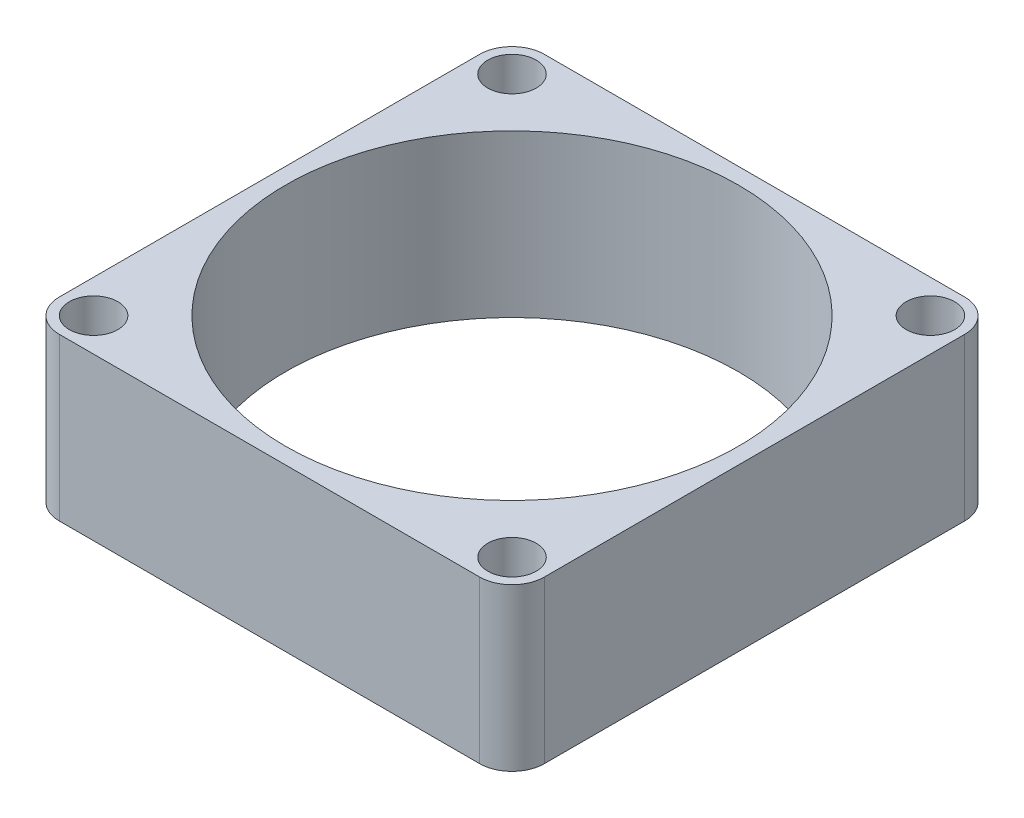
ISO-10303-21;
HEADER;
FILE_DESCRIPTION(('STEP AP214'),'2;1');
FILE_NAME('part.step','',(''),(''),'','','');
FILE_SCHEMA(('AUTOMOTIVE_DESIGN { 1 0 10303 214 1 1 1 1 }'));
ENDSEC;
DATA;
#1=APPLICATION_CONTEXT('core data for automotive mechanical design processes');
#2=APPLICATION_PROTOCOL_DEFINITION('international standard','automotive_design',2000,#1);
#3=PRODUCT_CONTEXT('',#1,'mechanical');
#4=PRODUCT('Part','Part','',(#3));
#5=PRODUCT_RELATED_PRODUCT_CATEGORY('part','',(#4));
#6=PRODUCT_DEFINITION_FORMATION('','',#4);
#7=PRODUCT_DEFINITION_CONTEXT('part definition',#1,'design');
#8=PRODUCT_DEFINITION('design','',#6,#7);
#9=PRODUCT_DEFINITION_SHAPE('','',#8);
#10=(LENGTH_UNIT() NAMED_UNIT(*) SI_UNIT(.MILLI.,.METRE.));
#11=(NAMED_UNIT(*) PLANE_ANGLE_UNIT() SI_UNIT($,.RADIAN.));
#12=(NAMED_UNIT(*) SI_UNIT($,.STERADIAN.) SOLID_ANGLE_UNIT());
#13=UNCERTAINTY_MEASURE_WITH_UNIT(LENGTH_MEASURE(1.E-05),#10,'distance_accuracy_value','');
#14=(GEOMETRIC_REPRESENTATION_CONTEXT(3) GLOBAL_UNCERTAINTY_ASSIGNED_CONTEXT((#13)) GLOBAL_UNIT_ASSIGNED_CONTEXT((#10,
#11,#12)) REPRESENTATION_CONTEXT('',''));
#15=CARTESIAN_POINT('',(0.,0.,0.));
#16=DIRECTION('',(0.,0.,1.));
#17=DIRECTION('',(1.,0.,0.));
#18=AXIS2_PLACEMENT_3D('',#15,#16,#17);
#19=CARTESIAN_POINT('',(-15.,10.,15.));
#20=DIRECTION('',(1.,0.,0.));
#21=DIRECTION('',(0.,0.,-1.));
#22=AXIS2_PLACEMENT_3D('',#19,#20,#21);
#23=PLANE('',#22);
#24=DIRECTION('',(0.,0.,1.));
#25=VECTOR('',#24,1.);
#26=CARTESIAN_POINT('',(-15.,0.,15.));
#27=LINE('',#26,#25);
#28=CARTESIAN_POINT('',(-15.,0.,-13.));
#29=VERTEX_POINT('',#28);
#30=CARTESIAN_POINT('',(-15.,0.,13.));
#31=VERTEX_POINT('',#30);
#32=EDGE_CURVE('E115',#29,#31,#27,.T.);
#33=ORIENTED_EDGE('',*,*,#32,.T.);
#34=DIRECTION('',(0.,-1.,0.));
#35=VECTOR('',#34,1.);
#36=CARTESIAN_POINT('',(-15.,10.,13.));
#37=LINE('',#36,#35);
#38=CARTESIAN_POINT('',(-15.,10.,13.));
#39=VERTEX_POINT('',#38);
#40=EDGE_CURVE('E12',#31,#39,#37,.F.);
#41=ORIENTED_EDGE('',*,*,#40,.T.);
#42=DIRECTION('',(0.,0.,1.));
#43=VECTOR('',#42,1.);
#44=CARTESIAN_POINT('',(-15.,10.,15.));
#45=LINE('',#44,#43);
#46=CARTESIAN_POINT('',(-15.,10.,-13.));
#47=VERTEX_POINT('',#46);
#48=EDGE_CURVE('E117',#47,#39,#45,.T.);
#49=ORIENTED_EDGE('',*,*,#48,.F.);
#50=DIRECTION('',(0.,-1.,0.));
#51=VECTOR('',#50,1.);
#52=CARTESIAN_POINT('',(-15.,10.,-13.));
#53=LINE('',#52,#51);
#54=EDGE_CURVE('E105',#47,#29,#53,.T.);
#55=ORIENTED_EDGE('',*,*,#54,.T.);
#56=EDGE_LOOP('',(#33,#41,#49,#55));
#57=FACE_BOUND('',#56,.T.);
#58=ADVANCED_FACE('F35',(#57),#23,.F.);
#59=CARTESIAN_POINT('',(15.,10.,15.));
#60=DIRECTION('',(0.,0.,-1.));
#61=DIRECTION('',(-1.,0.,0.));
#62=AXIS2_PLACEMENT_3D('',#59,#60,#61);
#63=PLANE('',#62);
#64=DIRECTION('',(1.,0.,0.));
#65=VECTOR('',#64,1.);
#66=CARTESIAN_POINT('',(15.,0.,15.));
#67=LINE('',#66,#65);
#68=CARTESIAN_POINT('',(-13.,0.,15.));
#69=VERTEX_POINT('',#68);
#70=CARTESIAN_POINT('',(13.,0.,15.));
#71=VERTEX_POINT('',#70);
#72=EDGE_CURVE('E123',#69,#71,#67,.T.);
#73=ORIENTED_EDGE('',*,*,#72,.T.);
#74=DIRECTION('',(0.,-1.,0.));
#75=VECTOR('',#74,1.);
#76=CARTESIAN_POINT('',(13.,10.,15.));
#77=LINE('',#76,#75);
#78=CARTESIAN_POINT('',(13.,10.,15.));
#79=VERTEX_POINT('',#78);
#80=EDGE_CURVE('E43',#71,#79,#77,.F.);
#81=ORIENTED_EDGE('',*,*,#80,.T.);
#82=DIRECTION('',(1.,0.,0.));
#83=VECTOR('',#82,1.);
#84=CARTESIAN_POINT('',(15.,10.,15.));
#85=LINE('',#84,#83);
#86=CARTESIAN_POINT('',(-13.,10.,15.));
#87=VERTEX_POINT('',#86);
#88=EDGE_CURVE('E163',#87,#79,#85,.T.);
#89=ORIENTED_EDGE('',*,*,#88,.F.);
#90=DIRECTION('',(0.,-1.,0.));
#91=VECTOR('',#90,1.);
#92=CARTESIAN_POINT('',(-13.,10.,15.));
#93=LINE('',#92,#91);
#94=EDGE_CURVE('E159',#87,#69,#93,.T.);
#95=ORIENTED_EDGE('',*,*,#94,.T.);
#96=EDGE_LOOP('',(#73,#81,#89,#95));
#97=FACE_BOUND('',#96,.T.);
#98=ADVANCED_FACE('F162',(#97),#63,.F.);
#99=CARTESIAN_POINT('',(15.,10.,15.));
#100=DIRECTION('',(-1.,0.,0.));
#101=DIRECTION('',(0.,0.,1.));
#102=AXIS2_PLACEMENT_3D('',#99,#100,#101);
#103=PLANE('',#102);
#104=DIRECTION('',(0.,0.,-1.));
#105=VECTOR('',#104,1.);
#106=CARTESIAN_POINT('',(15.,0.,15.));
#107=LINE('',#106,#105);
#108=CARTESIAN_POINT('',(15.,0.,13.));
#109=VERTEX_POINT('',#108);
#110=CARTESIAN_POINT('',(15.,0.,-13.));
#111=VERTEX_POINT('',#110);
#112=EDGE_CURVE('E126',#109,#111,#107,.T.);
#113=ORIENTED_EDGE('',*,*,#112,.T.);
#114=DIRECTION('',(0.,-1.,0.));
#115=VECTOR('',#114,1.);
#116=CARTESIAN_POINT('',(15.,10.,-13.));
#117=LINE('',#116,#115);
#118=CARTESIAN_POINT('',(15.,10.,-13.));
#119=VERTEX_POINT('',#118);
#120=EDGE_CURVE('E152',#111,#119,#117,.F.);
#121=ORIENTED_EDGE('',*,*,#120,.T.);
#122=DIRECTION('',(0.,0.,-1.));
#123=VECTOR('',#122,1.);
#124=CARTESIAN_POINT('',(15.,10.,15.));
#125=LINE('',#124,#123);
#126=CARTESIAN_POINT('',(15.,10.,13.));
#127=VERTEX_POINT('',#126);
#128=EDGE_CURVE('E175',#127,#119,#125,.T.);
#129=ORIENTED_EDGE('',*,*,#128,.F.);
#130=DIRECTION('',(0.,-1.,0.));
#131=VECTOR('',#130,1.);
#132=CARTESIAN_POINT('',(15.,10.,13.));
#133=LINE('',#132,#131);
#134=EDGE_CURVE('E149',#127,#109,#133,.T.);
#135=ORIENTED_EDGE('',*,*,#134,.T.);
#136=EDGE_LOOP('',(#113,#121,#129,#135));
#137=FACE_BOUND('',#136,.T.);
#138=ADVANCED_FACE('F172',(#137),#103,.F.);
#139=CARTESIAN_POINT('',(15.,10.,-15.));
#140=DIRECTION('',(0.,0.,1.));
#141=DIRECTION('',(1.,0.,0.));
#142=AXIS2_PLACEMENT_3D('',#139,#140,#141);
#143=PLANE('',#142);
#144=DIRECTION('',(-1.,0.,0.));
#145=VECTOR('',#144,1.);
#146=CARTESIAN_POINT('',(15.,10.,-15.));
#147=LINE('',#146,#145);
#148=CARTESIAN_POINT('',(13.,10.,-15.));
#149=VERTEX_POINT('',#148);
#150=CARTESIAN_POINT('',(-13.,10.,-15.));
#151=VERTEX_POINT('',#150);
#152=EDGE_CURVE('E118',#149,#151,#147,.T.);
#153=ORIENTED_EDGE('',*,*,#152,.F.);
#154=DIRECTION('',(0.,-1.,0.));
#155=VECTOR('',#154,1.);
#156=CARTESIAN_POINT('',(13.,10.,-15.));
#157=LINE('',#156,#155);
#158=CARTESIAN_POINT('',(13.,0.,-15.));
#159=VERTEX_POINT('',#158);
#160=EDGE_CURVE('E141',#149,#159,#157,.T.);
#161=ORIENTED_EDGE('',*,*,#160,.T.);
#162=DIRECTION('',(-1.,0.,0.));
#163=VECTOR('',#162,1.);
#164=CARTESIAN_POINT('',(15.,0.,-15.));
#165=LINE('',#164,#163);
#166=CARTESIAN_POINT('',(-13.,0.,-15.));
#167=VERTEX_POINT('',#166);
#168=EDGE_CURVE('E136',#159,#167,#165,.T.);
#169=ORIENTED_EDGE('',*,*,#168,.T.);
#170=DIRECTION('',(0.,-1.,0.));
#171=VECTOR('',#170,1.);
#172=CARTESIAN_POINT('',(-13.,10.,-15.));
#173=LINE('',#172,#171);
#174=EDGE_CURVE('E107',#167,#151,#173,.F.);
#175=ORIENTED_EDGE('',*,*,#174,.T.);
#176=EDGE_LOOP('',(#153,#161,#169,#175));
#177=FACE_BOUND('',#176,.T.);
#178=ADVANCED_FACE('F251',(#177),#143,.F.);
#179=CARTESIAN_POINT('',(0.,10.,0.));
#180=DIRECTION('',(0.,1.,0.));
#181=DIRECTION('',(0.,0.,1.));
#182=AXIS2_PLACEMENT_3D('',#179,#180,#181);
#183=PLANE('',#182);
#184=CARTESIAN_POINT('',(0.,10.,0.));
#185=DIRECTION('',(0.,1.,0.));
#186=DIRECTION('',(0.,0.,1.));
#187=AXIS2_PLACEMENT_3D('',#184,#185,#186);
#188=CIRCLE('',#187,14.);
#189=CARTESIAN_POINT('',(0.,10.,14.));
#190=VERTEX_POINT('',#189);
#191=EDGE_CURVE('E198',#190,#190,#188,.T.);
#192=ORIENTED_EDGE('',*,*,#191,.F.);
#193=EDGE_LOOP('',(#192));
#194=FACE_BOUND('',#193,.T.);
#195=CARTESIAN_POINT('',(12.9394908396224,10.,-12.9394908396224));
#196=DIRECTION('',(0.,1.,0.));
#197=DIRECTION('',(0.,0.,1.));
#198=AXIS2_PLACEMENT_3D('',#195,#196,#197);
#199=CIRCLE('',#198,1.5);
#200=CARTESIAN_POINT('',(12.9394908396224,10.,-11.4394908396224));
#201=VERTEX_POINT('',#200);
#202=EDGE_CURVE('E192',#201,#201,#199,.T.);
#203=ORIENTED_EDGE('',*,*,#202,.F.);
#204=EDGE_LOOP('',(#203));
#205=FACE_BOUND('',#204,.T.);
#206=CARTESIAN_POINT('',(12.9394908396224,10.,12.9394908396224));
#207=DIRECTION('',(0.,1.,0.));
#208=DIRECTION('',(0.,0.,1.));
#209=AXIS2_PLACEMENT_3D('',#206,#207,#208);
#210=CIRCLE('',#209,1.5);
#211=CARTESIAN_POINT('',(12.9394908396224,10.,14.4394908396224));
#212=VERTEX_POINT('',#211);
#213=EDGE_CURVE('E186',#212,#212,#210,.T.);
#214=ORIENTED_EDGE('',*,*,#213,.F.);
#215=EDGE_LOOP('',(#214));
#216=FACE_BOUND('',#215,.T.);
#217=CARTESIAN_POINT('',(-12.9394908396224,10.,12.9394908396224));
#218=DIRECTION('',(0.,1.,0.));
#219=DIRECTION('',(0.,0.,1.));
#220=AXIS2_PLACEMENT_3D('',#217,#218,#219);
#221=CIRCLE('',#220,1.5);
#222=CARTESIAN_POINT('',(-12.9394908396224,10.,14.4394908396224));
#223=VERTEX_POINT('',#222);
#224=EDGE_CURVE('E183',#223,#223,#221,.T.);
#225=ORIENTED_EDGE('',*,*,#224,.F.);
#226=EDGE_LOOP('',(#225));
#227=FACE_BOUND('',#226,.T.);
#228=CARTESIAN_POINT('',(-12.9394908396224,10.,-12.9394908396224));
#229=DIRECTION('',(0.,1.,0.));
#230=DIRECTION('',(0.,0.,1.));
#231=AXIS2_PLACEMENT_3D('',#228,#229,#230);
#232=CIRCLE('',#231,1.5);
#233=CARTESIAN_POINT('',(-12.9394908396224,10.,-11.4394908396224));
#234=VERTEX_POINT('',#233);
#235=EDGE_CURVE('E129',#234,#234,#232,.T.);
#236=ORIENTED_EDGE('',*,*,#235,.F.);
#237=EDGE_LOOP('',(#236));
#238=FACE_BOUND('',#237,.T.);
#239=ORIENTED_EDGE('',*,*,#128,.T.);
#240=CARTESIAN_POINT('',(13.,10.,-13.));
#241=DIRECTION('',(0.,1.,0.));
#242=DIRECTION('',(0.,0.,1.));
#243=AXIS2_PLACEMENT_3D('',#240,#241,#242);
#244=CIRCLE('',#243,2.);
#245=EDGE_CURVE('E157',#119,#149,#244,.T.);
#246=ORIENTED_EDGE('',*,*,#245,.T.);
#247=ORIENTED_EDGE('',*,*,#152,.T.);
#248=CARTESIAN_POINT('',(-13.,10.,-13.));
#249=DIRECTION('',(0.,1.,0.));
#250=DIRECTION('',(0.,0.,1.));
#251=AXIS2_PLACEMENT_3D('',#248,#249,#250);
#252=CIRCLE('',#251,2.);
#253=EDGE_CURVE('E139',#151,#47,#252,.T.);
#254=ORIENTED_EDGE('',*,*,#253,.T.);
#255=ORIENTED_EDGE('',*,*,#48,.T.);
#256=CARTESIAN_POINT('',(-13.,10.,13.));
#257=DIRECTION('',(0.,1.,0.));
#258=DIRECTION('',(0.,0.,1.));
#259=AXIS2_PLACEMENT_3D('',#256,#257,#258);
#260=CIRCLE('',#259,2.);
#261=EDGE_CURVE('E56',#39,#87,#260,.T.);
#262=ORIENTED_EDGE('',*,*,#261,.T.);
#263=ORIENTED_EDGE('',*,*,#88,.T.);
#264=CARTESIAN_POINT('',(13.,10.,13.));
#265=DIRECTION('',(0.,1.,0.));
#266=DIRECTION('',(0.,0.,1.));
#267=AXIS2_PLACEMENT_3D('',#264,#265,#266);
#268=CIRCLE('',#267,2.);
#269=EDGE_CURVE('E155',#79,#127,#268,.T.);
#270=ORIENTED_EDGE('',*,*,#269,.T.);
#271=EDGE_LOOP('',(#239,#246,#247,#254,#255,#262,#263,#270));
#272=FACE_BOUND('',#271,.T.);
#273=ADVANCED_FACE('F246',(#194,#205,#216,#227,#238,#272),#183,.T.);
#274=CARTESIAN_POINT('',(0.,0.,0.));
#275=DIRECTION('',(0.,1.,0.));
#276=DIRECTION('',(0.,0.,1.));
#277=AXIS2_PLACEMENT_3D('',#274,#275,#276);
#278=PLANE('',#277);
#279=CARTESIAN_POINT('',(0.,0.,0.));
#280=DIRECTION('',(0.,1.,0.));
#281=DIRECTION('',(0.,0.,1.));
#282=AXIS2_PLACEMENT_3D('',#279,#280,#281);
#283=CIRCLE('',#282,14.);
#284=CARTESIAN_POINT('',(0.,0.,14.));
#285=VERTEX_POINT('',#284);
#286=EDGE_CURVE('E203',#285,#285,#283,.T.);
#287=ORIENTED_EDGE('',*,*,#286,.T.);
#288=EDGE_LOOP('',(#287));
#289=FACE_BOUND('',#288,.T.);
#290=CARTESIAN_POINT('',(12.9394908396224,0.,-12.9394908396224));
#291=DIRECTION('',(0.,1.,0.));
#292=DIRECTION('',(0.,0.,1.));
#293=AXIS2_PLACEMENT_3D('',#290,#291,#292);
#294=CIRCLE('',#293,1.5);
#295=CARTESIAN_POINT('',(12.9394908396224,0.,-11.4394908396224));
#296=VERTEX_POINT('',#295);
#297=EDGE_CURVE('E195',#296,#296,#294,.T.);
#298=ORIENTED_EDGE('',*,*,#297,.T.);
#299=EDGE_LOOP('',(#298));
#300=FACE_BOUND('',#299,.T.);
#301=CARTESIAN_POINT('',(12.9394908396224,0.,12.9394908396224));
#302=DIRECTION('',(0.,1.,0.));
#303=DIRECTION('',(0.,0.,1.));
#304=AXIS2_PLACEMENT_3D('',#301,#302,#303);
#305=CIRCLE('',#304,1.5);
#306=CARTESIAN_POINT('',(12.9394908396224,0.,14.4394908396224));
#307=VERTEX_POINT('',#306);
#308=EDGE_CURVE('E189',#307,#307,#305,.T.);
#309=ORIENTED_EDGE('',*,*,#308,.T.);
#310=EDGE_LOOP('',(#309));
#311=FACE_BOUND('',#310,.T.);
#312=CARTESIAN_POINT('',(-12.9394908396224,0.,12.9394908396224));
#313=DIRECTION('',(0.,1.,0.));
#314=DIRECTION('',(0.,0.,1.));
#315=AXIS2_PLACEMENT_3D('',#312,#313,#314);
#316=CIRCLE('',#315,1.5);
#317=CARTESIAN_POINT('',(-12.9394908396224,0.,14.4394908396224));
#318=VERTEX_POINT('',#317);
#319=EDGE_CURVE('E181',#318,#318,#316,.T.);
#320=ORIENTED_EDGE('',*,*,#319,.T.);
#321=EDGE_LOOP('',(#320));
#322=FACE_BOUND('',#321,.T.);
#323=CARTESIAN_POINT('',(-12.9394908396224,0.,-12.9394908396224));
#324=DIRECTION('',(0.,1.,0.));
#325=DIRECTION('',(0.,0.,1.));
#326=AXIS2_PLACEMENT_3D('',#323,#324,#325);
#327=CIRCLE('',#326,1.5);
#328=CARTESIAN_POINT('',(-12.9394908396224,0.,-11.4394908396224));
#329=VERTEX_POINT('',#328);
#330=EDGE_CURVE('E124',#329,#329,#327,.T.);
#331=ORIENTED_EDGE('',*,*,#330,.T.);
#332=EDGE_LOOP('',(#331));
#333=FACE_BOUND('',#332,.T.);
#334=ORIENTED_EDGE('',*,*,#168,.F.);
#335=CARTESIAN_POINT('',(13.,0.,-13.));
#336=DIRECTION('',(0.,1.,0.));
#337=DIRECTION('',(0.,0.,1.));
#338=AXIS2_PLACEMENT_3D('',#335,#336,#337);
#339=CIRCLE('',#338,2.);
#340=EDGE_CURVE('E147',#159,#111,#339,.F.);
#341=ORIENTED_EDGE('',*,*,#340,.T.);
#342=ORIENTED_EDGE('',*,*,#112,.F.);
#343=CARTESIAN_POINT('',(13.,0.,13.));
#344=DIRECTION('',(0.,1.,0.));
#345=DIRECTION('',(0.,0.,1.));
#346=AXIS2_PLACEMENT_3D('',#343,#344,#345);
#347=CIRCLE('',#346,2.);
#348=EDGE_CURVE('E145',#109,#71,#347,.F.);
#349=ORIENTED_EDGE('',*,*,#348,.T.);
#350=ORIENTED_EDGE('',*,*,#72,.F.);
#351=CARTESIAN_POINT('',(-13.,0.,13.));
#352=DIRECTION('',(0.,1.,0.));
#353=DIRECTION('',(0.,0.,1.));
#354=AXIS2_PLACEMENT_3D('',#351,#352,#353);
#355=CIRCLE('',#354,2.);
#356=EDGE_CURVE('E122',#69,#31,#355,.F.);
#357=ORIENTED_EDGE('',*,*,#356,.T.);
#358=ORIENTED_EDGE('',*,*,#32,.F.);
#359=CARTESIAN_POINT('',(-13.,0.,-13.));
#360=DIRECTION('',(0.,1.,0.));
#361=DIRECTION('',(0.,0.,1.));
#362=AXIS2_PLACEMENT_3D('',#359,#360,#361);
#363=CIRCLE('',#362,2.);
#364=EDGE_CURVE('E101',#29,#167,#363,.F.);
#365=ORIENTED_EDGE('',*,*,#364,.T.);
#366=EDGE_LOOP('',(#334,#341,#342,#349,#350,#357,#358,#365));
#367=FACE_BOUND('',#366,.T.);
#368=ADVANCED_FACE('F120',(#289,#300,#311,#322,#333,#367),#278,.F.);
#369=CARTESIAN_POINT('',(-12.9394908396224,0.,-12.9394908396224));
#370=DIRECTION('',(0.,1.,0.));
#371=DIRECTION('',(0.,0.,1.));
#372=AXIS2_PLACEMENT_3D('',#369,#370,#371);
#373=CYLINDRICAL_SURFACE('',#372,1.5);
#374=ORIENTED_EDGE('',*,*,#330,.F.);
#375=EDGE_LOOP('',(#374));
#376=FACE_BOUND('',#375,.T.);
#377=ORIENTED_EDGE('',*,*,#235,.T.);
#378=EDGE_LOOP('',(#377));
#379=FACE_BOUND('',#378,.T.);
#380=ADVANCED_FACE('F262',(#376,#379),#373,.F.);
#381=CARTESIAN_POINT('',(-12.9394908396224,0.,12.9394908396224));
#382=DIRECTION('',(0.,1.,0.));
#383=DIRECTION('',(0.,0.,1.));
#384=AXIS2_PLACEMENT_3D('',#381,#382,#383);
#385=CYLINDRICAL_SURFACE('',#384,1.5);
#386=ORIENTED_EDGE('',*,*,#319,.F.);
#387=EDGE_LOOP('',(#386));
#388=FACE_BOUND('',#387,.T.);
#389=ORIENTED_EDGE('',*,*,#224,.T.);
#390=EDGE_LOOP('',(#389));
#391=FACE_BOUND('',#390,.T.);
#392=ADVANCED_FACE('F275',(#388,#391),#385,.F.);
#393=CARTESIAN_POINT('',(12.9394908396224,0.,12.9394908396224));
#394=DIRECTION('',(0.,1.,0.));
#395=DIRECTION('',(0.,0.,1.));
#396=AXIS2_PLACEMENT_3D('',#393,#394,#395);
#397=CYLINDRICAL_SURFACE('',#396,1.5);
#398=ORIENTED_EDGE('',*,*,#308,.F.);
#399=EDGE_LOOP('',(#398));
#400=FACE_BOUND('',#399,.T.);
#401=ORIENTED_EDGE('',*,*,#213,.T.);
#402=EDGE_LOOP('',(#401));
#403=FACE_BOUND('',#402,.T.);
#404=ADVANCED_FACE('F282',(#400,#403),#397,.F.);
#405=CARTESIAN_POINT('',(12.9394908396224,0.,-12.9394908396224));
#406=DIRECTION('',(0.,1.,0.));
#407=DIRECTION('',(0.,0.,1.));
#408=AXIS2_PLACEMENT_3D('',#405,#406,#407);
#409=CYLINDRICAL_SURFACE('',#408,1.5);
#410=ORIENTED_EDGE('',*,*,#297,.F.);
#411=EDGE_LOOP('',(#410));
#412=FACE_BOUND('',#411,.T.);
#413=ORIENTED_EDGE('',*,*,#202,.T.);
#414=EDGE_LOOP('',(#413));
#415=FACE_BOUND('',#414,.T.);
#416=ADVANCED_FACE('F228',(#412,#415),#409,.F.);
#417=CARTESIAN_POINT('',(-13.,10.,-13.));
#418=DIRECTION('',(0.,-1.,0.));
#419=DIRECTION('',(0.,0.,-1.));
#420=AXIS2_PLACEMENT_3D('',#417,#418,#419);
#421=CYLINDRICAL_SURFACE('',#420,2.);
#422=ORIENTED_EDGE('',*,*,#253,.F.);
#423=ORIENTED_EDGE('',*,*,#174,.F.);
#424=ORIENTED_EDGE('',*,*,#364,.F.);
#425=ORIENTED_EDGE('',*,*,#54,.F.);
#426=EDGE_LOOP('',(#422,#423,#424,#425));
#427=FACE_BOUND('',#426,.T.);
#428=ADVANCED_FACE('F104',(#427),#421,.T.);
#429=CARTESIAN_POINT('',(13.,10.,-13.));
#430=DIRECTION('',(0.,-1.,0.));
#431=DIRECTION('',(0.,0.,-1.));
#432=AXIS2_PLACEMENT_3D('',#429,#430,#431);
#433=CYLINDRICAL_SURFACE('',#432,2.);
#434=ORIENTED_EDGE('',*,*,#245,.F.);
#435=ORIENTED_EDGE('',*,*,#120,.F.);
#436=ORIENTED_EDGE('',*,*,#340,.F.);
#437=ORIENTED_EDGE('',*,*,#160,.F.);
#438=EDGE_LOOP('',(#434,#435,#436,#437));
#439=FACE_BOUND('',#438,.T.);
#440=ADVANCED_FACE('F227',(#439),#433,.T.);
#441=CARTESIAN_POINT('',(13.,10.,13.));
#442=DIRECTION('',(0.,-1.,0.));
#443=DIRECTION('',(0.,0.,-1.));
#444=AXIS2_PLACEMENT_3D('',#441,#442,#443);
#445=CYLINDRICAL_SURFACE('',#444,2.);
#446=ORIENTED_EDGE('',*,*,#269,.F.);
#447=ORIENTED_EDGE('',*,*,#80,.F.);
#448=ORIENTED_EDGE('',*,*,#348,.F.);
#449=ORIENTED_EDGE('',*,*,#134,.F.);
#450=EDGE_LOOP('',(#446,#447,#448,#449));
#451=FACE_BOUND('',#450,.T.);
#452=ADVANCED_FACE('F169',(#451),#445,.T.);
#453=CARTESIAN_POINT('',(-13.,10.,13.));
#454=DIRECTION('',(0.,-1.,0.));
#455=DIRECTION('',(0.,0.,-1.));
#456=AXIS2_PLACEMENT_3D('',#453,#454,#455);
#457=CYLINDRICAL_SURFACE('',#456,2.);
#458=ORIENTED_EDGE('',*,*,#261,.F.);
#459=ORIENTED_EDGE('',*,*,#40,.F.);
#460=ORIENTED_EDGE('',*,*,#356,.F.);
#461=ORIENTED_EDGE('',*,*,#94,.F.);
#462=EDGE_LOOP('',(#458,#459,#460,#461));
#463=FACE_BOUND('',#462,.T.);
#464=ADVANCED_FACE('F37',(#463),#457,.T.);
#465=CARTESIAN_POINT('',(0.,0.,0.));
#466=DIRECTION('',(0.,1.,0.));
#467=DIRECTION('',(0.,0.,1.));
#468=AXIS2_PLACEMENT_3D('',#465,#466,#467);
#469=CYLINDRICAL_SURFACE('',#468,14.);
#470=ORIENTED_EDGE('',*,*,#191,.T.);
#471=EDGE_LOOP('',(#470));
#472=FACE_BOUND('',#471,.T.);
#473=ORIENTED_EDGE('',*,*,#286,.F.);
#474=EDGE_LOOP('',(#473));
#475=FACE_BOUND('',#474,.T.);
#476=ADVANCED_FACE('F209',(#472,#475),#469,.F.);
#477=CLOSED_SHELL('',(#58,#98,#138,#178,#273,#368,#380,#392,#404,#416,#428,#440,#452,#464,#476));
#478=MANIFOLD_SOLID_BREP('B2',#477);
#479=ADVANCED_BREP_SHAPE_REPRESENTATION('',(#18,#478),#14);
#480=SHAPE_DEFINITION_REPRESENTATION(#9,#479);
ENDSEC;
END-ISO-10303-21;
